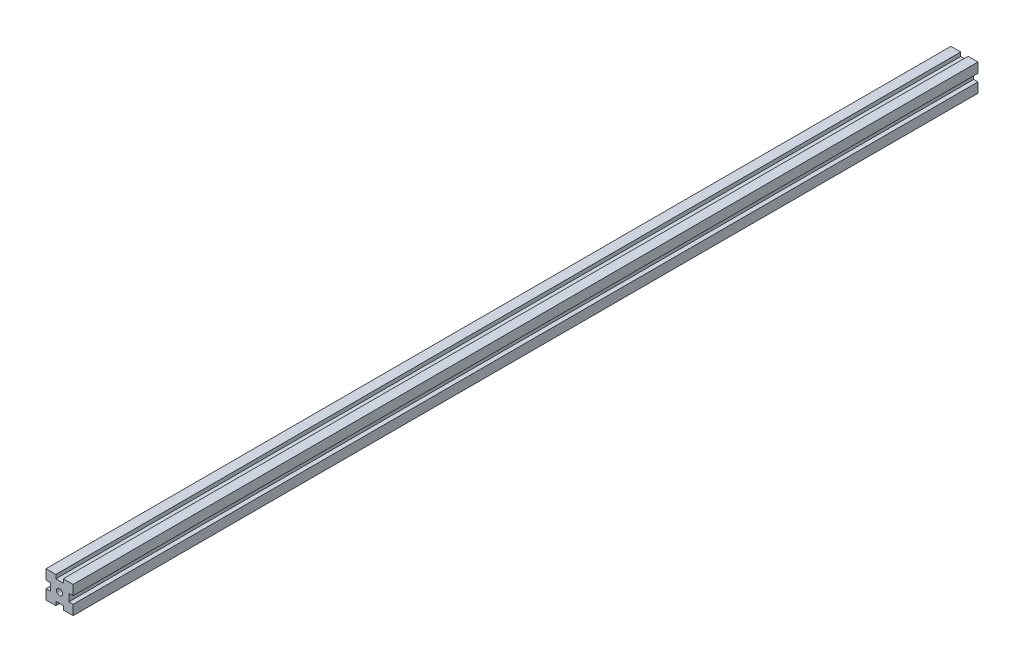
ISO-10303-21;
HEADER;
FILE_DESCRIPTION(('STEP AP214'),'2;1');
FILE_NAME('part.step','',(''),(''),'','','');
FILE_SCHEMA(('AUTOMOTIVE_DESIGN { 1 0 10303 214 1 1 1 1 }'));
ENDSEC;
DATA;
#1=APPLICATION_CONTEXT('core data for automotive mechanical design processes');
#2=APPLICATION_PROTOCOL_DEFINITION('international standard','automotive_design',2000,#1);
#3=PRODUCT_CONTEXT('',#1,'mechanical');
#4=PRODUCT('Part','Part','',(#3));
#5=PRODUCT_RELATED_PRODUCT_CATEGORY('part','',(#4));
#6=PRODUCT_DEFINITION_FORMATION('','',#4);
#7=PRODUCT_DEFINITION_CONTEXT('part definition',#1,'design');
#8=PRODUCT_DEFINITION('design','',#6,#7);
#9=PRODUCT_DEFINITION_SHAPE('','',#8);
#10=(LENGTH_UNIT() NAMED_UNIT(*) SI_UNIT(.MILLI.,.METRE.));
#11=(NAMED_UNIT(*) PLANE_ANGLE_UNIT() SI_UNIT($,.RADIAN.));
#12=(NAMED_UNIT(*) SI_UNIT($,.STERADIAN.) SOLID_ANGLE_UNIT());
#13=UNCERTAINTY_MEASURE_WITH_UNIT(LENGTH_MEASURE(1.E-05),#10,'distance_accuracy_value','');
#14=(GEOMETRIC_REPRESENTATION_CONTEXT(3) GLOBAL_UNCERTAINTY_ASSIGNED_CONTEXT((#13)) GLOBAL_UNIT_ASSIGNED_CONTEXT((#10,
#11,#12)) REPRESENTATION_CONTEXT('',''));
#15=CARTESIAN_POINT('',(0.,0.,0.));
#16=DIRECTION('',(0.,0.,1.));
#17=DIRECTION('',(1.,0.,0.));
#18=AXIS2_PLACEMENT_3D('',#15,#16,#17);
#19=CARTESIAN_POINT('',(0.,0.,1000.));
#20=DIRECTION('',(0.,0.,1.));
#21=DIRECTION('',(1.,0.,0.));
#22=AXIS2_PLACEMENT_3D('',#19,#20,#21);
#23=PLANE('',#22);
#24=DIRECTION('',(0.,-1.,0.));
#25=VECTOR('',#24,1.);
#26=CARTESIAN_POINT('',(-11.6494845360825,14.4845360824742,1000.));
#27=LINE('',#26,#25);
#28=CARTESIAN_POINT('',(-11.6494845360825,14.4845360824742,1000.));
#29=VERTEX_POINT('',#28);
#30=CARTESIAN_POINT('',(-11.6494845360825,3.58453608247423,1000.));
#31=VERTEX_POINT('',#30);
#32=EDGE_CURVE('E277',#29,#31,#27,.T.);
#33=ORIENTED_EDGE('',*,*,#32,.T.);
#34=DIRECTION('',(1.,0.,0.));
#35=VECTOR('',#34,1.);
#36=CARTESIAN_POINT('',(-11.6494845360825,3.58453608247423,1000.));
#37=LINE('',#36,#35);
#38=CARTESIAN_POINT('',(-6.89300768146049,3.58453608247423,1000.));
#39=VERTEX_POINT('',#38);
#40=EDGE_CURVE('E141',#31,#39,#37,.T.);
#41=ORIENTED_EDGE('',*,*,#40,.T.);
#42=DIRECTION('',(0.,-1.,0.));
#43=VECTOR('',#42,1.);
#44=CARTESIAN_POINT('',(-6.89300768146049,3.58453608247423,1000.));
#45=LINE('',#44,#43);
#46=CARTESIAN_POINT('',(-6.89300768146049,-4.61546391752577,1000.));
#47=VERTEX_POINT('',#46);
#48=EDGE_CURVE('E346',#39,#47,#45,.T.);
#49=ORIENTED_EDGE('',*,*,#48,.T.);
#50=DIRECTION('',(-1.,0.,0.));
#51=VECTOR('',#50,1.);
#52=CARTESIAN_POINT('',(-11.6494845360825,-4.61546391752577,1000.));
#53=LINE('',#52,#51);
#54=CARTESIAN_POINT('',(-11.6494845360825,-4.61546391752577,1000.));
#55=VERTEX_POINT('',#54);
#56=EDGE_CURVE('E366',#47,#55,#53,.T.);
#57=ORIENTED_EDGE('',*,*,#56,.T.);
#58=DIRECTION('',(0.,-1.,0.));
#59=VECTOR('',#58,1.);
#60=CARTESIAN_POINT('',(-11.6494845360825,-4.61546391752577,1000.));
#61=LINE('',#60,#59);
#62=CARTESIAN_POINT('',(-11.6494845360825,-15.5154639175258,1000.));
#63=VERTEX_POINT('',#62);
#64=EDGE_CURVE('E362',#55,#63,#61,.T.);
#65=ORIENTED_EDGE('',*,*,#64,.T.);
#66=DIRECTION('',(1.,0.,0.));
#67=VECTOR('',#66,1.);
#68=CARTESIAN_POINT('',(-11.6494845360825,-15.5154639175258,1000.));
#69=LINE('',#68,#67);
#70=CARTESIAN_POINT('',(-0.749484536082483,-15.5154639175258,1000.));
#71=VERTEX_POINT('',#70);
#72=EDGE_CURVE('E365',#63,#71,#69,.T.);
#73=ORIENTED_EDGE('',*,*,#72,.T.);
#74=DIRECTION('',(0.,1.,0.));
#75=VECTOR('',#74,1.);
#76=CARTESIAN_POINT('',(-0.749484536082483,-15.5154639175258,1000.));
#77=LINE('',#76,#75);
#78=CARTESIAN_POINT('',(-0.749484536082483,-11.2443418439877,1000.));
#79=VERTEX_POINT('',#78);
#80=EDGE_CURVE('E370',#71,#79,#77,.T.);
#81=ORIENTED_EDGE('',*,*,#80,.T.);
#82=DIRECTION('',(1.,0.,0.));
#83=VECTOR('',#82,1.);
#84=CARTESIAN_POINT('',(-0.749484536082483,-11.2443418439877,1000.));
#85=LINE('',#84,#83);
#86=CARTESIAN_POINT('',(7.45051546391751,-11.2443418439877,1000.));
#87=VERTEX_POINT('',#86);
#88=EDGE_CURVE('E377',#79,#87,#85,.T.);
#89=ORIENTED_EDGE('',*,*,#88,.T.);
#90=DIRECTION('',(0.,-1.,0.));
#91=VECTOR('',#90,1.);
#92=CARTESIAN_POINT('',(7.45051546391751,-15.5154639175258,1000.));
#93=LINE('',#92,#91);
#94=CARTESIAN_POINT('',(7.45051546391751,-15.5154639175258,1000.));
#95=VERTEX_POINT('',#94);
#96=EDGE_CURVE('E380',#87,#95,#93,.T.);
#97=ORIENTED_EDGE('',*,*,#96,.T.);
#98=DIRECTION('',(1.,0.,0.));
#99=VECTOR('',#98,1.);
#100=CARTESIAN_POINT('',(7.45051546391751,-15.5154639175258,1000.));
#101=LINE('',#100,#99);
#102=CARTESIAN_POINT('',(18.3505154639175,-15.5154639175258,1000.));
#103=VERTEX_POINT('',#102);
#104=EDGE_CURVE('E383',#95,#103,#101,.T.);
#105=ORIENTED_EDGE('',*,*,#104,.T.);
#106=DIRECTION('',(0.,1.,0.));
#107=VECTOR('',#106,1.);
#108=CARTESIAN_POINT('',(18.3505154639175,-4.61546391752577,1000.));
#109=LINE('',#108,#107);
#110=CARTESIAN_POINT('',(18.3505154639175,-4.61546391752577,1000.));
#111=VERTEX_POINT('',#110);
#112=EDGE_CURVE('E386',#103,#111,#109,.T.);
#113=ORIENTED_EDGE('',*,*,#112,.T.);
#114=DIRECTION('',(-1.,0.,0.));
#115=VECTOR('',#114,1.);
#116=CARTESIAN_POINT('',(18.3505154639175,-4.61546391752577,1000.));
#117=LINE('',#116,#115);
#118=CARTESIAN_POINT('',(13.5940386092955,-4.61546391752577,1000.));
#119=VERTEX_POINT('',#118);
#120=EDGE_CURVE('E389',#111,#119,#117,.T.);
#121=ORIENTED_EDGE('',*,*,#120,.T.);
#122=DIRECTION('',(0.,1.,0.));
#123=VECTOR('',#122,1.);
#124=CARTESIAN_POINT('',(13.5940386092955,3.58453608247423,1000.));
#125=LINE('',#124,#123);
#126=CARTESIAN_POINT('',(13.5940386092955,3.58453608247423,1000.));
#127=VERTEX_POINT('',#126);
#128=EDGE_CURVE('E392',#119,#127,#125,.T.);
#129=ORIENTED_EDGE('',*,*,#128,.T.);
#130=DIRECTION('',(1.,0.,0.));
#131=VECTOR('',#130,1.);
#132=CARTESIAN_POINT('',(18.3505154639175,3.58453608247423,1000.));
#133=LINE('',#132,#131);
#134=CARTESIAN_POINT('',(18.3505154639175,3.58453608247423,1000.));
#135=VERTEX_POINT('',#134);
#136=EDGE_CURVE('E395',#127,#135,#133,.T.);
#137=ORIENTED_EDGE('',*,*,#136,.T.);
#138=DIRECTION('',(0.,1.,0.));
#139=VECTOR('',#138,1.);
#140=CARTESIAN_POINT('',(18.3505154639175,14.4845360824742,1000.));
#141=LINE('',#140,#139);
#142=CARTESIAN_POINT('',(18.3505154639175,14.4845360824742,1000.));
#143=VERTEX_POINT('',#142);
#144=EDGE_CURVE('E398',#135,#143,#141,.T.);
#145=ORIENTED_EDGE('',*,*,#144,.T.);
#146=DIRECTION('',(-1.,0.,0.));
#147=VECTOR('',#146,1.);
#148=CARTESIAN_POINT('',(7.45051546391752,14.4845360824742,1000.));
#149=LINE('',#148,#147);
#150=CARTESIAN_POINT('',(7.45051546391752,14.4845360824742,1000.));
#151=VERTEX_POINT('',#150);
#152=EDGE_CURVE('E401',#143,#151,#149,.T.);
#153=ORIENTED_EDGE('',*,*,#152,.T.);
#154=DIRECTION('',(0.,-1.,0.));
#155=VECTOR('',#154,1.);
#156=CARTESIAN_POINT('',(7.45051546391752,14.4845360824742,1000.));
#157=LINE('',#156,#155);
#158=CARTESIAN_POINT('',(7.45051546391752,10.2134140089361,1000.));
#159=VERTEX_POINT('',#158);
#160=EDGE_CURVE('E196',#151,#159,#157,.T.);
#161=ORIENTED_EDGE('',*,*,#160,.T.);
#162=DIRECTION('',(-1.,0.,0.));
#163=VECTOR('',#162,1.);
#164=CARTESIAN_POINT('',(-0.749484536082476,10.2134140089361,1000.));
#165=LINE('',#164,#163);
#166=CARTESIAN_POINT('',(-0.749484536082476,10.2134140089361,1000.));
#167=VERTEX_POINT('',#166);
#168=EDGE_CURVE('E190',#159,#167,#165,.T.);
#169=ORIENTED_EDGE('',*,*,#168,.T.);
#170=DIRECTION('',(0.,1.,0.));
#171=VECTOR('',#170,1.);
#172=CARTESIAN_POINT('',(-0.749484536082476,14.4845360824742,1000.));
#173=LINE('',#172,#171);
#174=CARTESIAN_POINT('',(-0.749484536082476,14.4845360824742,1000.));
#175=VERTEX_POINT('',#174);
#176=EDGE_CURVE('E194',#167,#175,#173,.T.);
#177=ORIENTED_EDGE('',*,*,#176,.T.);
#178=DIRECTION('',(-1.,0.,0.));
#179=VECTOR('',#178,1.);
#180=CARTESIAN_POINT('',(-11.6494845360825,14.4845360824742,1000.));
#181=LINE('',#180,#179);
#182=EDGE_CURVE('E62',#175,#29,#181,.T.);
#183=ORIENTED_EDGE('',*,*,#182,.T.);
#184=EDGE_LOOP('',(#33,#41,#49,#57,#65,#73,#81,#89,#97,#105,#113,#121,#129,#137,#145,#153,#161,
#169,#177,#183));
#185=FACE_BOUND('',#184,.T.);
#186=CARTESIAN_POINT('',(3.35051546391753,-0.515463917525773,1000.));
#187=DIRECTION('',(0.,0.,1.));
#188=DIRECTION('',(1.,0.,0.));
#189=AXIS2_PLACEMENT_3D('',#186,#187,#188);
#190=CIRCLE('',#189,3.4);
#191=CARTESIAN_POINT('',(6.75051546391753,-0.515463917525773,1000.));
#192=VERTEX_POINT('',#191);
#193=EDGE_CURVE('E223',#192,#192,#190,.T.);
#194=ORIENTED_EDGE('',*,*,#193,.F.);
#195=EDGE_LOOP('',(#194));
#196=FACE_BOUND('',#195,.T.);
#197=ADVANCED_FACE('F44',(#185,#196),#23,.T.);
#198=CARTESIAN_POINT('',(0.,0.,0.));
#199=DIRECTION('',(0.,0.,1.));
#200=DIRECTION('',(1.,0.,0.));
#201=AXIS2_PLACEMENT_3D('',#198,#199,#200);
#202=PLANE('',#201);
#203=DIRECTION('',(0.,-1.,0.));
#204=VECTOR('',#203,1.);
#205=CARTESIAN_POINT('',(-11.6494845360825,14.4845360824742,0.));
#206=LINE('',#205,#204);
#207=CARTESIAN_POINT('',(-11.6494845360825,14.4845360824742,0.));
#208=VERTEX_POINT('',#207);
#209=CARTESIAN_POINT('',(-11.6494845360825,3.58453608247423,0.));
#210=VERTEX_POINT('',#209);
#211=EDGE_CURVE('E218',#208,#210,#206,.T.);
#212=ORIENTED_EDGE('',*,*,#211,.F.);
#213=DIRECTION('',(-1.,0.,0.));
#214=VECTOR('',#213,1.);
#215=CARTESIAN_POINT('',(-11.6494845360825,14.4845360824742,0.));
#216=LINE('',#215,#214);
#217=CARTESIAN_POINT('',(-0.749484536082476,14.4845360824742,0.));
#218=VERTEX_POINT('',#217);
#219=EDGE_CURVE('E133',#218,#208,#216,.T.);
#220=ORIENTED_EDGE('',*,*,#219,.F.);
#221=DIRECTION('',(0.,1.,0.));
#222=VECTOR('',#221,1.);
#223=CARTESIAN_POINT('',(-0.749484536082476,14.4845360824742,0.));
#224=LINE('',#223,#222);
#225=CARTESIAN_POINT('',(-0.749484536082476,10.2134140089361,0.));
#226=VERTEX_POINT('',#225);
#227=EDGE_CURVE('E127',#226,#218,#224,.T.);
#228=ORIENTED_EDGE('',*,*,#227,.F.);
#229=DIRECTION('',(-1.,0.,0.));
#230=VECTOR('',#229,1.);
#231=CARTESIAN_POINT('',(-0.749484536082476,10.2134140089361,0.));
#232=LINE('',#231,#230);
#233=CARTESIAN_POINT('',(7.45051546391752,10.2134140089361,0.));
#234=VERTEX_POINT('',#233);
#235=EDGE_CURVE('E205',#234,#226,#232,.T.);
#236=ORIENTED_EDGE('',*,*,#235,.F.);
#237=DIRECTION('',(0.,-1.,0.));
#238=VECTOR('',#237,1.);
#239=CARTESIAN_POINT('',(7.45051546391752,14.4845360824742,0.));
#240=LINE('',#239,#238);
#241=CARTESIAN_POINT('',(7.45051546391752,14.4845360824742,0.));
#242=VERTEX_POINT('',#241);
#243=EDGE_CURVE('E268',#242,#234,#240,.T.);
#244=ORIENTED_EDGE('',*,*,#243,.F.);
#245=DIRECTION('',(-1.,0.,0.));
#246=VECTOR('',#245,1.);
#247=CARTESIAN_POINT('',(7.45051546391752,14.4845360824742,0.));
#248=LINE('',#247,#246);
#249=CARTESIAN_POINT('',(18.3505154639175,14.4845360824742,0.));
#250=VERTEX_POINT('',#249);
#251=EDGE_CURVE('E265',#250,#242,#248,.T.);
#252=ORIENTED_EDGE('',*,*,#251,.F.);
#253=DIRECTION('',(0.,1.,0.));
#254=VECTOR('',#253,1.);
#255=CARTESIAN_POINT('',(18.3505154639175,14.4845360824742,0.));
#256=LINE('',#255,#254);
#257=CARTESIAN_POINT('',(18.3505154639175,3.58453608247423,0.));
#258=VERTEX_POINT('',#257);
#259=EDGE_CURVE('E262',#258,#250,#256,.T.);
#260=ORIENTED_EDGE('',*,*,#259,.F.);
#261=DIRECTION('',(1.,0.,0.));
#262=VECTOR('',#261,1.);
#263=CARTESIAN_POINT('',(18.3505154639175,3.58453608247423,0.));
#264=LINE('',#263,#262);
#265=CARTESIAN_POINT('',(13.5940386092955,3.58453608247423,0.));
#266=VERTEX_POINT('',#265);
#267=EDGE_CURVE('E259',#266,#258,#264,.T.);
#268=ORIENTED_EDGE('',*,*,#267,.F.);
#269=DIRECTION('',(0.,1.,0.));
#270=VECTOR('',#269,1.);
#271=CARTESIAN_POINT('',(13.5940386092955,3.58453608247423,0.));
#272=LINE('',#271,#270);
#273=CARTESIAN_POINT('',(13.5940386092955,-4.61546391752577,0.));
#274=VERTEX_POINT('',#273);
#275=EDGE_CURVE('E256',#274,#266,#272,.T.);
#276=ORIENTED_EDGE('',*,*,#275,.F.);
#277=DIRECTION('',(-1.,0.,0.));
#278=VECTOR('',#277,1.);
#279=CARTESIAN_POINT('',(18.3505154639175,-4.61546391752577,0.));
#280=LINE('',#279,#278);
#281=CARTESIAN_POINT('',(18.3505154639175,-4.61546391752577,0.));
#282=VERTEX_POINT('',#281);
#283=EDGE_CURVE('E253',#282,#274,#280,.T.);
#284=ORIENTED_EDGE('',*,*,#283,.F.);
#285=DIRECTION('',(0.,1.,0.));
#286=VECTOR('',#285,1.);
#287=CARTESIAN_POINT('',(18.3505154639175,-4.61546391752577,0.));
#288=LINE('',#287,#286);
#289=CARTESIAN_POINT('',(18.3505154639175,-15.5154639175258,0.));
#290=VERTEX_POINT('',#289);
#291=EDGE_CURVE('E250',#290,#282,#288,.T.);
#292=ORIENTED_EDGE('',*,*,#291,.F.);
#293=DIRECTION('',(1.,0.,0.));
#294=VECTOR('',#293,1.);
#295=CARTESIAN_POINT('',(7.45051546391751,-15.5154639175258,0.));
#296=LINE('',#295,#294);
#297=CARTESIAN_POINT('',(7.45051546391751,-15.5154639175258,0.));
#298=VERTEX_POINT('',#297);
#299=EDGE_CURVE('E247',#298,#290,#296,.T.);
#300=ORIENTED_EDGE('',*,*,#299,.F.);
#301=DIRECTION('',(0.,-1.,0.));
#302=VECTOR('',#301,1.);
#303=CARTESIAN_POINT('',(7.45051546391751,-15.5154639175258,0.));
#304=LINE('',#303,#302);
#305=CARTESIAN_POINT('',(7.45051546391751,-11.2443418439877,0.));
#306=VERTEX_POINT('',#305);
#307=EDGE_CURVE('E244',#306,#298,#304,.T.);
#308=ORIENTED_EDGE('',*,*,#307,.F.);
#309=DIRECTION('',(1.,0.,0.));
#310=VECTOR('',#309,1.);
#311=CARTESIAN_POINT('',(-0.749484536082483,-11.2443418439877,0.));
#312=LINE('',#311,#310);
#313=CARTESIAN_POINT('',(-0.749484536082483,-11.2443418439877,0.));
#314=VERTEX_POINT('',#313);
#315=EDGE_CURVE('E241',#314,#306,#312,.T.);
#316=ORIENTED_EDGE('',*,*,#315,.F.);
#317=DIRECTION('',(0.,1.,0.));
#318=VECTOR('',#317,1.);
#319=CARTESIAN_POINT('',(-0.749484536082483,-15.5154639175258,0.));
#320=LINE('',#319,#318);
#321=CARTESIAN_POINT('',(-0.749484536082483,-15.5154639175258,0.));
#322=VERTEX_POINT('',#321);
#323=EDGE_CURVE('E238',#322,#314,#320,.T.);
#324=ORIENTED_EDGE('',*,*,#323,.F.);
#325=DIRECTION('',(1.,0.,0.));
#326=VECTOR('',#325,1.);
#327=CARTESIAN_POINT('',(-11.6494845360825,-15.5154639175258,0.));
#328=LINE('',#327,#326);
#329=CARTESIAN_POINT('',(-11.6494845360825,-15.5154639175258,0.));
#330=VERTEX_POINT('',#329);
#331=EDGE_CURVE('E235',#330,#322,#328,.T.);
#332=ORIENTED_EDGE('',*,*,#331,.F.);
#333=DIRECTION('',(0.,-1.,0.));
#334=VECTOR('',#333,1.);
#335=CARTESIAN_POINT('',(-11.6494845360825,-4.61546391752577,0.));
#336=LINE('',#335,#334);
#337=CARTESIAN_POINT('',(-11.6494845360825,-4.61546391752577,0.));
#338=VERTEX_POINT('',#337);
#339=EDGE_CURVE('E232',#338,#330,#336,.T.);
#340=ORIENTED_EDGE('',*,*,#339,.F.);
#341=DIRECTION('',(-1.,0.,0.));
#342=VECTOR('',#341,1.);
#343=CARTESIAN_POINT('',(-11.6494845360825,-4.61546391752577,0.));
#344=LINE('',#343,#342);
#345=CARTESIAN_POINT('',(-6.89300768146049,-4.61546391752577,0.));
#346=VERTEX_POINT('',#345);
#347=EDGE_CURVE('E229',#346,#338,#344,.T.);
#348=ORIENTED_EDGE('',*,*,#347,.F.);
#349=DIRECTION('',(0.,-1.,0.));
#350=VECTOR('',#349,1.);
#351=CARTESIAN_POINT('',(-6.89300768146049,3.58453608247423,0.));
#352=LINE('',#351,#350);
#353=CARTESIAN_POINT('',(-6.89300768146049,3.58453608247423,0.));
#354=VERTEX_POINT('',#353);
#355=EDGE_CURVE('E226',#354,#346,#352,.T.);
#356=ORIENTED_EDGE('',*,*,#355,.F.);
#357=DIRECTION('',(1.,0.,0.));
#358=VECTOR('',#357,1.);
#359=CARTESIAN_POINT('',(-11.6494845360825,3.58453608247423,0.));
#360=LINE('',#359,#358);
#361=EDGE_CURVE('E222',#210,#354,#360,.T.);
#362=ORIENTED_EDGE('',*,*,#361,.F.);
#363=EDGE_LOOP('',(#212,#220,#228,#236,#244,#252,#260,#268,#276,#284,#292,#300,#308,#316,#324,
#332,#340,#348,#356,#362));
#364=FACE_BOUND('',#363,.T.);
#365=CARTESIAN_POINT('',(3.35051546391753,-0.515463917525773,0.));
#366=DIRECTION('',(0.,0.,1.));
#367=DIRECTION('',(1.,0.,0.));
#368=AXIS2_PLACEMENT_3D('',#365,#366,#367);
#369=CIRCLE('',#368,3.4);
#370=CARTESIAN_POINT('',(6.75051546391753,-0.515463917525773,0.));
#371=VERTEX_POINT('',#370);
#372=EDGE_CURVE('E654',#371,#371,#369,.T.);
#373=ORIENTED_EDGE('',*,*,#372,.T.);
#374=EDGE_LOOP('',(#373));
#375=FACE_BOUND('',#374,.T.);
#376=ADVANCED_FACE('F350',(#364,#375),#202,.F.);
#377=CARTESIAN_POINT('',(-11.6494845360825,14.4845360824742,1000.));
#378=DIRECTION('',(1.,0.,0.));
#379=DIRECTION('',(0.,0.,-1.));
#380=AXIS2_PLACEMENT_3D('',#377,#378,#379);
#381=PLANE('',#380);
#382=ORIENTED_EDGE('',*,*,#211,.T.);
#383=DIRECTION('',(0.,0.,-1.));
#384=VECTOR('',#383,1.);
#385=CARTESIAN_POINT('',(-11.6494845360825,3.58453608247423,1000.));
#386=LINE('',#385,#384);
#387=EDGE_CURVE('E11',#31,#210,#386,.T.);
#388=ORIENTED_EDGE('',*,*,#387,.F.);
#389=ORIENTED_EDGE('',*,*,#32,.F.);
#390=DIRECTION('',(0.,0.,-1.));
#391=VECTOR('',#390,1.);
#392=CARTESIAN_POINT('',(-11.6494845360825,14.4845360824742,1000.));
#393=LINE('',#392,#391);
#394=EDGE_CURVE('E214',#29,#208,#393,.T.);
#395=ORIENTED_EDGE('',*,*,#394,.T.);
#396=EDGE_LOOP('',(#382,#388,#389,#395));
#397=FACE_BOUND('',#396,.T.);
#398=ADVANCED_FACE('F46',(#397),#381,.F.);
#399=CARTESIAN_POINT('',(-11.6494845360825,3.58453608247423,1000.));
#400=DIRECTION('',(0.,1.,0.));
#401=DIRECTION('',(0.,0.,1.));
#402=AXIS2_PLACEMENT_3D('',#399,#400,#401);
#403=PLANE('',#402);
#404=ORIENTED_EDGE('',*,*,#361,.T.);
#405=DIRECTION('',(0.,0.,-1.));
#406=VECTOR('',#405,1.);
#407=CARTESIAN_POINT('',(-6.89300768146049,3.58453608247423,1000.));
#408=LINE('',#407,#406);
#409=EDGE_CURVE('E54',#39,#354,#408,.T.);
#410=ORIENTED_EDGE('',*,*,#409,.F.);
#411=ORIENTED_EDGE('',*,*,#40,.F.);
#412=ORIENTED_EDGE('',*,*,#387,.T.);
#413=EDGE_LOOP('',(#404,#410,#411,#412));
#414=FACE_BOUND('',#413,.T.);
#415=ADVANCED_FACE('F437',(#414),#403,.F.);
#416=CARTESIAN_POINT('',(-6.89300768146049,3.58453608247423,1000.));
#417=DIRECTION('',(1.,0.,0.));
#418=DIRECTION('',(0.,0.,-1.));
#419=AXIS2_PLACEMENT_3D('',#416,#417,#418);
#420=PLANE('',#419);
#421=ORIENTED_EDGE('',*,*,#355,.T.);
#422=DIRECTION('',(0.,0.,-1.));
#423=VECTOR('',#422,1.);
#424=CARTESIAN_POINT('',(-6.89300768146049,-4.61546391752577,1000.));
#425=LINE('',#424,#423);
#426=EDGE_CURVE('E336',#47,#346,#425,.T.);
#427=ORIENTED_EDGE('',*,*,#426,.F.);
#428=ORIENTED_EDGE('',*,*,#48,.F.);
#429=ORIENTED_EDGE('',*,*,#409,.T.);
#430=EDGE_LOOP('',(#421,#427,#428,#429));
#431=FACE_BOUND('',#430,.T.);
#432=ADVANCED_FACE('F344',(#431),#420,.F.);
#433=CARTESIAN_POINT('',(-11.6494845360825,-4.61546391752577,1000.));
#434=DIRECTION('',(0.,-1.,0.));
#435=DIRECTION('',(0.,0.,-1.));
#436=AXIS2_PLACEMENT_3D('',#433,#434,#435);
#437=PLANE('',#436);
#438=ORIENTED_EDGE('',*,*,#347,.T.);
#439=DIRECTION('',(0.,0.,-1.));
#440=VECTOR('',#439,1.);
#441=CARTESIAN_POINT('',(-11.6494845360825,-4.61546391752577,1000.));
#442=LINE('',#441,#440);
#443=EDGE_CURVE('E332',#55,#338,#442,.T.);
#444=ORIENTED_EDGE('',*,*,#443,.F.);
#445=ORIENTED_EDGE('',*,*,#56,.F.);
#446=ORIENTED_EDGE('',*,*,#426,.T.);
#447=EDGE_LOOP('',(#438,#444,#445,#446));
#448=FACE_BOUND('',#447,.T.);
#449=ADVANCED_FACE('F356',(#448),#437,.F.);
#450=CARTESIAN_POINT('',(-11.6494845360825,-4.61546391752577,1000.));
#451=DIRECTION('',(1.,0.,0.));
#452=DIRECTION('',(0.,1.,0.));
#453=AXIS2_PLACEMENT_3D('',#450,#451,#452);
#454=PLANE('',#453);
#455=ORIENTED_EDGE('',*,*,#339,.T.);
#456=DIRECTION('',(0.,0.,-1.));
#457=VECTOR('',#456,1.);
#458=CARTESIAN_POINT('',(-11.6494845360825,-15.5154639175258,1000.));
#459=LINE('',#458,#457);
#460=EDGE_CURVE('E328',#63,#330,#459,.T.);
#461=ORIENTED_EDGE('',*,*,#460,.F.);
#462=ORIENTED_EDGE('',*,*,#64,.F.);
#463=ORIENTED_EDGE('',*,*,#443,.T.);
#464=EDGE_LOOP('',(#455,#461,#462,#463));
#465=FACE_BOUND('',#464,.T.);
#466=ADVANCED_FACE('F360',(#465),#454,.F.);
#467=CARTESIAN_POINT('',(-11.6494845360825,-15.5154639175258,1000.));
#468=DIRECTION('',(0.,1.,0.));
#469=DIRECTION('',(0.,0.,1.));
#470=AXIS2_PLACEMENT_3D('',#467,#468,#469);
#471=PLANE('',#470);
#472=ORIENTED_EDGE('',*,*,#331,.T.);
#473=DIRECTION('',(0.,0.,-1.));
#474=VECTOR('',#473,1.);
#475=CARTESIAN_POINT('',(-0.749484536082483,-15.5154639175258,1000.));
#476=LINE('',#475,#474);
#477=EDGE_CURVE('E324',#71,#322,#476,.T.);
#478=ORIENTED_EDGE('',*,*,#477,.F.);
#479=ORIENTED_EDGE('',*,*,#72,.F.);
#480=ORIENTED_EDGE('',*,*,#460,.T.);
#481=EDGE_LOOP('',(#472,#478,#479,#480));
#482=FACE_BOUND('',#481,.T.);
#483=ADVANCED_FACE('F450',(#482),#471,.F.);
#484=CARTESIAN_POINT('',(-0.749484536082483,-15.5154639175258,1000.));
#485=DIRECTION('',(-1.,0.,0.));
#486=DIRECTION('',(0.,-1.,0.));
#487=AXIS2_PLACEMENT_3D('',#484,#485,#486);
#488=PLANE('',#487);
#489=ORIENTED_EDGE('',*,*,#323,.T.);
#490=DIRECTION('',(0.,0.,-1.));
#491=VECTOR('',#490,1.);
#492=CARTESIAN_POINT('',(-0.749484536082483,-11.2443418439877,1000.));
#493=LINE('',#492,#491);
#494=EDGE_CURVE('E320',#79,#314,#493,.T.);
#495=ORIENTED_EDGE('',*,*,#494,.F.);
#496=ORIENTED_EDGE('',*,*,#80,.F.);
#497=ORIENTED_EDGE('',*,*,#477,.T.);
#498=EDGE_LOOP('',(#489,#495,#496,#497));
#499=FACE_BOUND('',#498,.T.);
#500=ADVANCED_FACE('F453',(#499),#488,.F.);
#501=CARTESIAN_POINT('',(-0.749484536082483,-11.2443418439877,1000.));
#502=DIRECTION('',(0.,1.,0.));
#503=DIRECTION('',(0.,0.,1.));
#504=AXIS2_PLACEMENT_3D('',#501,#502,#503);
#505=PLANE('',#504);
#506=ORIENTED_EDGE('',*,*,#315,.T.);
#507=DIRECTION('',(0.,0.,-1.));
#508=VECTOR('',#507,1.);
#509=CARTESIAN_POINT('',(7.45051546391751,-11.2443418439877,1000.));
#510=LINE('',#509,#508);
#511=EDGE_CURVE('E316',#87,#306,#510,.T.);
#512=ORIENTED_EDGE('',*,*,#511,.F.);
#513=ORIENTED_EDGE('',*,*,#88,.F.);
#514=ORIENTED_EDGE('',*,*,#494,.T.);
#515=EDGE_LOOP('',(#506,#512,#513,#514));
#516=FACE_BOUND('',#515,.T.);
#517=ADVANCED_FACE('F457',(#516),#505,.F.);
#518=CARTESIAN_POINT('',(7.45051546391751,-15.5154639175258,1000.));
#519=DIRECTION('',(1.,0.,0.));
#520=DIRECTION('',(0.,1.,0.));
#521=AXIS2_PLACEMENT_3D('',#518,#519,#520);
#522=PLANE('',#521);
#523=ORIENTED_EDGE('',*,*,#307,.T.);
#524=DIRECTION('',(0.,0.,-1.));
#525=VECTOR('',#524,1.);
#526=CARTESIAN_POINT('',(7.45051546391751,-15.5154639175258,1000.));
#527=LINE('',#526,#525);
#528=EDGE_CURVE('E312',#95,#298,#527,.T.);
#529=ORIENTED_EDGE('',*,*,#528,.F.);
#530=ORIENTED_EDGE('',*,*,#96,.F.);
#531=ORIENTED_EDGE('',*,*,#511,.T.);
#532=EDGE_LOOP('',(#523,#529,#530,#531));
#533=FACE_BOUND('',#532,.T.);
#534=ADVANCED_FACE('F461',(#533),#522,.F.);
#535=CARTESIAN_POINT('',(7.45051546391751,-15.5154639175258,1000.));
#536=DIRECTION('',(0.,1.,0.));
#537=DIRECTION('',(0.,0.,1.));
#538=AXIS2_PLACEMENT_3D('',#535,#536,#537);
#539=PLANE('',#538);
#540=ORIENTED_EDGE('',*,*,#299,.T.);
#541=DIRECTION('',(0.,0.,-1.));
#542=VECTOR('',#541,1.);
#543=CARTESIAN_POINT('',(18.3505154639175,-15.5154639175258,1000.));
#544=LINE('',#543,#542);
#545=EDGE_CURVE('E308',#103,#290,#544,.T.);
#546=ORIENTED_EDGE('',*,*,#545,.F.);
#547=ORIENTED_EDGE('',*,*,#104,.F.);
#548=ORIENTED_EDGE('',*,*,#528,.T.);
#549=EDGE_LOOP('',(#540,#546,#547,#548));
#550=FACE_BOUND('',#549,.T.);
#551=ADVANCED_FACE('F465',(#550),#539,.F.);
#552=CARTESIAN_POINT('',(18.3505154639175,-4.61546391752577,1000.));
#553=DIRECTION('',(-1.,0.,0.));
#554=DIRECTION('',(0.,-1.,0.));
#555=AXIS2_PLACEMENT_3D('',#552,#553,#554);
#556=PLANE('',#555);
#557=ORIENTED_EDGE('',*,*,#291,.T.);
#558=DIRECTION('',(0.,0.,-1.));
#559=VECTOR('',#558,1.);
#560=CARTESIAN_POINT('',(18.3505154639175,-4.61546391752577,1000.));
#561=LINE('',#560,#559);
#562=EDGE_CURVE('E304',#111,#282,#561,.T.);
#563=ORIENTED_EDGE('',*,*,#562,.F.);
#564=ORIENTED_EDGE('',*,*,#112,.F.);
#565=ORIENTED_EDGE('',*,*,#545,.T.);
#566=EDGE_LOOP('',(#557,#563,#564,#565));
#567=FACE_BOUND('',#566,.T.);
#568=ADVANCED_FACE('F469',(#567),#556,.F.);
#569=CARTESIAN_POINT('',(18.3505154639175,-4.61546391752577,1000.));
#570=DIRECTION('',(0.,-1.,0.));
#571=DIRECTION('',(0.,0.,-1.));
#572=AXIS2_PLACEMENT_3D('',#569,#570,#571);
#573=PLANE('',#572);
#574=ORIENTED_EDGE('',*,*,#283,.T.);
#575=DIRECTION('',(0.,0.,-1.));
#576=VECTOR('',#575,1.);
#577=CARTESIAN_POINT('',(13.5940386092955,-4.61546391752577,1000.));
#578=LINE('',#577,#576);
#579=EDGE_CURVE('E300',#119,#274,#578,.T.);
#580=ORIENTED_EDGE('',*,*,#579,.F.);
#581=ORIENTED_EDGE('',*,*,#120,.F.);
#582=ORIENTED_EDGE('',*,*,#562,.T.);
#583=EDGE_LOOP('',(#574,#580,#581,#582));
#584=FACE_BOUND('',#583,.T.);
#585=ADVANCED_FACE('F473',(#584),#573,.F.);
#586=CARTESIAN_POINT('',(13.5940386092955,3.58453608247423,1000.));
#587=DIRECTION('',(-1.,0.,0.));
#588=DIRECTION('',(0.,-1.,0.));
#589=AXIS2_PLACEMENT_3D('',#586,#587,#588);
#590=PLANE('',#589);
#591=ORIENTED_EDGE('',*,*,#275,.T.);
#592=DIRECTION('',(0.,0.,-1.));
#593=VECTOR('',#592,1.);
#594=CARTESIAN_POINT('',(13.5940386092955,3.58453608247423,1000.));
#595=LINE('',#594,#593);
#596=EDGE_CURVE('E296',#127,#266,#595,.T.);
#597=ORIENTED_EDGE('',*,*,#596,.F.);
#598=ORIENTED_EDGE('',*,*,#128,.F.);
#599=ORIENTED_EDGE('',*,*,#579,.T.);
#600=EDGE_LOOP('',(#591,#597,#598,#599));
#601=FACE_BOUND('',#600,.T.);
#602=ADVANCED_FACE('F477',(#601),#590,.F.);
#603=CARTESIAN_POINT('',(18.3505154639175,3.58453608247423,1000.));
#604=DIRECTION('',(0.,1.,0.));
#605=DIRECTION('',(0.,0.,1.));
#606=AXIS2_PLACEMENT_3D('',#603,#604,#605);
#607=PLANE('',#606);
#608=ORIENTED_EDGE('',*,*,#267,.T.);
#609=DIRECTION('',(0.,0.,-1.));
#610=VECTOR('',#609,1.);
#611=CARTESIAN_POINT('',(18.3505154639175,3.58453608247423,1000.));
#612=LINE('',#611,#610);
#613=EDGE_CURVE('E292',#135,#258,#612,.T.);
#614=ORIENTED_EDGE('',*,*,#613,.F.);
#615=ORIENTED_EDGE('',*,*,#136,.F.);
#616=ORIENTED_EDGE('',*,*,#596,.T.);
#617=EDGE_LOOP('',(#608,#614,#615,#616));
#618=FACE_BOUND('',#617,.T.);
#619=ADVANCED_FACE('F481',(#618),#607,.F.);
#620=CARTESIAN_POINT('',(18.3505154639175,14.4845360824742,1000.));
#621=DIRECTION('',(-1.,0.,0.));
#622=DIRECTION('',(0.,-1.,0.));
#623=AXIS2_PLACEMENT_3D('',#620,#621,#622);
#624=PLANE('',#623);
#625=ORIENTED_EDGE('',*,*,#259,.T.);
#626=DIRECTION('',(0.,0.,-1.));
#627=VECTOR('',#626,1.);
#628=CARTESIAN_POINT('',(18.3505154639175,14.4845360824742,1000.));
#629=LINE('',#628,#627);
#630=EDGE_CURVE('E288',#143,#250,#629,.T.);
#631=ORIENTED_EDGE('',*,*,#630,.F.);
#632=ORIENTED_EDGE('',*,*,#144,.F.);
#633=ORIENTED_EDGE('',*,*,#613,.T.);
#634=EDGE_LOOP('',(#625,#631,#632,#633));
#635=FACE_BOUND('',#634,.T.);
#636=ADVANCED_FACE('F485',(#635),#624,.F.);
#637=CARTESIAN_POINT('',(7.45051546391752,14.4845360824742,1000.));
#638=DIRECTION('',(0.,-1.,0.));
#639=DIRECTION('',(0.,0.,-1.));
#640=AXIS2_PLACEMENT_3D('',#637,#638,#639);
#641=PLANE('',#640);
#642=ORIENTED_EDGE('',*,*,#251,.T.);
#643=DIRECTION('',(0.,0.,-1.));
#644=VECTOR('',#643,1.);
#645=CARTESIAN_POINT('',(7.45051546391752,14.4845360824742,1000.));
#646=LINE('',#645,#644);
#647=EDGE_CURVE('E284',#151,#242,#646,.T.);
#648=ORIENTED_EDGE('',*,*,#647,.F.);
#649=ORIENTED_EDGE('',*,*,#152,.F.);
#650=ORIENTED_EDGE('',*,*,#630,.T.);
#651=EDGE_LOOP('',(#642,#648,#649,#650));
#652=FACE_BOUND('',#651,.T.);
#653=ADVANCED_FACE('F409',(#652),#641,.F.);
#654=CARTESIAN_POINT('',(7.45051546391752,14.4845360824742,1000.));
#655=DIRECTION('',(1.,0.,0.));
#656=DIRECTION('',(0.,1.,0.));
#657=AXIS2_PLACEMENT_3D('',#654,#655,#656);
#658=PLANE('',#657);
#659=ORIENTED_EDGE('',*,*,#243,.T.);
#660=DIRECTION('',(0.,0.,-1.));
#661=VECTOR('',#660,1.);
#662=CARTESIAN_POINT('',(7.45051546391752,10.2134140089361,1000.));
#663=LINE('',#662,#661);
#664=EDGE_CURVE('E207',#159,#234,#663,.T.);
#665=ORIENTED_EDGE('',*,*,#664,.F.);
#666=ORIENTED_EDGE('',*,*,#160,.F.);
#667=ORIENTED_EDGE('',*,*,#647,.T.);
#668=EDGE_LOOP('',(#659,#665,#666,#667));
#669=FACE_BOUND('',#668,.T.);
#670=ADVANCED_FACE('F413',(#669),#658,.F.);
#671=CARTESIAN_POINT('',(-0.749484536082476,10.2134140089361,1000.));
#672=DIRECTION('',(0.,-1.,0.));
#673=DIRECTION('',(0.,0.,-1.));
#674=AXIS2_PLACEMENT_3D('',#671,#672,#673);
#675=PLANE('',#674);
#676=ORIENTED_EDGE('',*,*,#235,.T.);
#677=DIRECTION('',(0.,0.,-1.));
#678=VECTOR('',#677,1.);
#679=CARTESIAN_POINT('',(-0.749484536082476,10.2134140089361,1000.));
#680=LINE('',#679,#678);
#681=EDGE_CURVE('E202',#167,#226,#680,.T.);
#682=ORIENTED_EDGE('',*,*,#681,.F.);
#683=ORIENTED_EDGE('',*,*,#168,.F.);
#684=ORIENTED_EDGE('',*,*,#664,.T.);
#685=EDGE_LOOP('',(#676,#682,#683,#684));
#686=FACE_BOUND('',#685,.T.);
#687=ADVANCED_FACE('F203',(#686),#675,.F.);
#688=CARTESIAN_POINT('',(-0.749484536082476,14.4845360824742,1000.));
#689=DIRECTION('',(-1.,0.,0.));
#690=DIRECTION('',(0.,-1.,0.));
#691=AXIS2_PLACEMENT_3D('',#688,#689,#690);
#692=PLANE('',#691);
#693=ORIENTED_EDGE('',*,*,#227,.T.);
#694=DIRECTION('',(0.,0.,-1.));
#695=VECTOR('',#694,1.);
#696=CARTESIAN_POINT('',(-0.749484536082476,14.4845360824742,1000.));
#697=LINE('',#696,#695);
#698=EDGE_CURVE('E208',#175,#218,#697,.T.);
#699=ORIENTED_EDGE('',*,*,#698,.F.);
#700=ORIENTED_EDGE('',*,*,#176,.F.);
#701=ORIENTED_EDGE('',*,*,#681,.T.);
#702=EDGE_LOOP('',(#693,#699,#700,#701));
#703=FACE_BOUND('',#702,.T.);
#704=ADVANCED_FACE('F210',(#703),#692,.F.);
#705=CARTESIAN_POINT('',(-11.6494845360825,14.4845360824742,1000.));
#706=DIRECTION('',(0.,-1.,0.));
#707=DIRECTION('',(0.,0.,-1.));
#708=AXIS2_PLACEMENT_3D('',#705,#706,#707);
#709=PLANE('',#708);
#710=ORIENTED_EDGE('',*,*,#219,.T.);
#711=ORIENTED_EDGE('',*,*,#394,.F.);
#712=ORIENTED_EDGE('',*,*,#182,.F.);
#713=ORIENTED_EDGE('',*,*,#698,.T.);
#714=EDGE_LOOP('',(#710,#711,#712,#713));
#715=FACE_BOUND('',#714,.T.);
#716=ADVANCED_FACE('F417',(#715),#709,.F.);
#717=CARTESIAN_POINT('',(3.35051546391753,-0.515463917525773,1000.));
#718=DIRECTION('',(0.,0.,-1.));
#719=DIRECTION('',(-1.,0.,0.));
#720=AXIS2_PLACEMENT_3D('',#717,#718,#719);
#721=CYLINDRICAL_SURFACE('',#720,3.4);
#722=ORIENTED_EDGE('',*,*,#193,.T.);
#723=EDGE_LOOP('',(#722));
#724=FACE_BOUND('',#723,.T.);
#725=ORIENTED_EDGE('',*,*,#372,.F.);
#726=EDGE_LOOP('',(#725));
#727=FACE_BOUND('',#726,.T.);
#728=ADVANCED_FACE('F419',(#724,#727),#721,.F.);
#729=CLOSED_SHELL('',(#197,#376,#398,#415,#432,#449,#466,#483,#500,#517,#534,#551,#568,#585,
#602,#619,#636,#653,#670,#687,#704,#716,#728));
#730=MANIFOLD_SOLID_BREP('B2',#729);
#731=ADVANCED_BREP_SHAPE_REPRESENTATION('',(#18,#730),#14);
#732=SHAPE_DEFINITION_REPRESENTATION(#9,#731);
ENDSEC;
END-ISO-10303-21;
